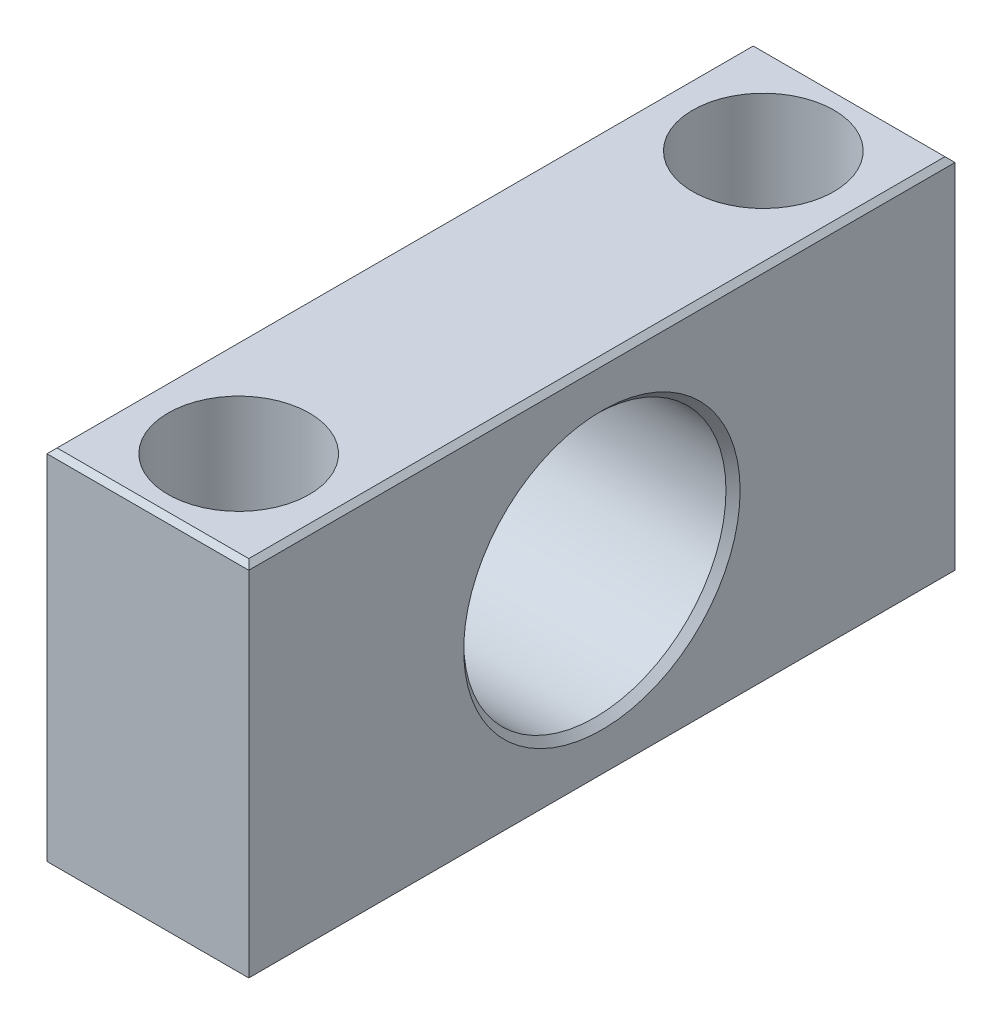
ISO-10303-21;
HEADER;
FILE_DESCRIPTION(('STEP AP214'),'2;1');
FILE_NAME('part.step','',(''),(''),'','','');
FILE_SCHEMA(('AUTOMOTIVE_DESIGN { 1 0 10303 214 1 1 1 1 }'));
ENDSEC;
DATA;
#1=APPLICATION_CONTEXT('core data for automotive mechanical design processes');
#2=APPLICATION_PROTOCOL_DEFINITION('international standard','automotive_design',2000,#1);
#3=PRODUCT_CONTEXT('',#1,'mechanical');
#4=PRODUCT('Part','Part','',(#3));
#5=PRODUCT_RELATED_PRODUCT_CATEGORY('part','',(#4));
#6=PRODUCT_DEFINITION_FORMATION('','',#4);
#7=PRODUCT_DEFINITION_CONTEXT('part definition',#1,'design');
#8=PRODUCT_DEFINITION('design','',#6,#7);
#9=PRODUCT_DEFINITION_SHAPE('','',#8);
#10=(LENGTH_UNIT() NAMED_UNIT(*) SI_UNIT(.MILLI.,.METRE.));
#11=(NAMED_UNIT(*) PLANE_ANGLE_UNIT() SI_UNIT($,.RADIAN.));
#12=(NAMED_UNIT(*) SI_UNIT($,.STERADIAN.) SOLID_ANGLE_UNIT());
#13=UNCERTAINTY_MEASURE_WITH_UNIT(LENGTH_MEASURE(1.E-05),#10,'distance_accuracy_value','');
#14=(GEOMETRIC_REPRESENTATION_CONTEXT(3) GLOBAL_UNCERTAINTY_ASSIGNED_CONTEXT((#13)) GLOBAL_UNIT_ASSIGNED_CONTEXT((#10,
#11,#12)) REPRESENTATION_CONTEXT('',''));
#15=CARTESIAN_POINT('',(0.,0.,0.));
#16=DIRECTION('',(0.,0.,1.));
#17=DIRECTION('',(1.,0.,0.));
#18=AXIS2_PLACEMENT_3D('',#15,#16,#17);
#19=CARTESIAN_POINT('',(15.75,-1.,26.));
#20=DIRECTION('',(0.,-1.,0.));
#21=DIRECTION('',(0.,0.,-1.));
#22=AXIS2_PLACEMENT_3D('',#19,#20,#21);
#23=PLANE('',#22);
#24=CARTESIAN_POINT('',(10.,-0.999999999999999,26.));
#25=DIRECTION('',(0.,-1.,0.));
#26=DIRECTION('',(0.,0.,-1.));
#27=AXIS2_PLACEMENT_3D('',#24,#25,#26);
#28=CIRCLE('',#27,4.5);
#29=CARTESIAN_POINT('',(10.,-0.999999999999999,21.5));
#30=VERTEX_POINT('',#29);
#31=EDGE_CURVE('E145',#30,#30,#28,.T.);
#32=ORIENTED_EDGE('',*,*,#31,.T.);
#33=EDGE_LOOP('',(#32));
#34=FACE_BOUND('',#33,.T.);
#35=CARTESIAN_POINT('',(10.,-1.,26.));
#36=DIRECTION('',(0.,-1.,0.));
#37=DIRECTION('',(0.,0.,-1.));
#38=AXIS2_PLACEMENT_3D('',#35,#36,#37);
#39=CIRCLE('',#38,7.);
#40=CARTESIAN_POINT('',(10.,-1.,19.));
#41=VERTEX_POINT('',#40);
#42=EDGE_CURVE('E147',#41,#41,#39,.F.);
#43=ORIENTED_EDGE('',*,*,#42,.T.);
#44=EDGE_LOOP('',(#43));
#45=FACE_BOUND('',#44,.T.);
#46=ADVANCED_FACE('F17',(#34,#45),#23,.F.);
#47=CARTESIAN_POINT('',(15.75,-1.,-26.));
#48=DIRECTION('',(0.,-1.,0.));
#49=DIRECTION('',(0.,0.,-1.));
#50=AXIS2_PLACEMENT_3D('',#47,#48,#49);
#51=PLANE('',#50);
#52=CARTESIAN_POINT('',(10.,-0.999999999999999,-26.));
#53=DIRECTION('',(0.,-1.,0.));
#54=DIRECTION('',(0.,0.,-1.));
#55=AXIS2_PLACEMENT_3D('',#52,#53,#54);
#56=CIRCLE('',#55,4.5);
#57=CARTESIAN_POINT('',(10.,-0.999999999999999,-30.5));
#58=VERTEX_POINT('',#57);
#59=EDGE_CURVE('E124',#58,#58,#56,.T.);
#60=ORIENTED_EDGE('',*,*,#59,.T.);
#61=EDGE_LOOP('',(#60));
#62=FACE_BOUND('',#61,.T.);
#63=CARTESIAN_POINT('',(10.,-1.,-26.));
#64=DIRECTION('',(0.,-1.,0.));
#65=DIRECTION('',(0.,0.,-1.));
#66=AXIS2_PLACEMENT_3D('',#63,#64,#65);
#67=CIRCLE('',#66,7.);
#68=CARTESIAN_POINT('',(10.,-1.,-33.));
#69=VERTEX_POINT('',#68);
#70=EDGE_CURVE('E20',#69,#69,#67,.F.);
#71=ORIENTED_EDGE('',*,*,#70,.T.);
#72=EDGE_LOOP('',(#71));
#73=FACE_BOUND('',#72,.T.);
#74=ADVANCED_FACE('F154',(#62,#73),#51,.F.);
#75=CARTESIAN_POINT('',(10.,8.5,-26.));
#76=DIRECTION('',(0.,-1.,0.));
#77=DIRECTION('',(0.,0.,-1.));
#78=AXIS2_PLACEMENT_3D('',#75,#76,#77);
#79=CYLINDRICAL_SURFACE('',#78,7.);
#80=CARTESIAN_POINT('',(10.,18.,-26.));
#81=DIRECTION('',(0.,-1.,0.));
#82=DIRECTION('',(0.,0.,-1.));
#83=AXIS2_PLACEMENT_3D('',#80,#81,#82);
#84=CIRCLE('',#83,7.);
#85=CARTESIAN_POINT('',(10.,18.,-33.));
#86=VERTEX_POINT('',#85);
#87=EDGE_CURVE('E109',#86,#86,#84,.T.);
#88=ORIENTED_EDGE('',*,*,#87,.F.);
#89=EDGE_LOOP('',(#88));
#90=FACE_BOUND('',#89,.T.);
#91=ORIENTED_EDGE('',*,*,#70,.F.);
#92=EDGE_LOOP('',(#91));
#93=FACE_BOUND('',#92,.T.);
#94=ADVANCED_FACE('F156',(#90,#93),#79,.F.);
#95=CARTESIAN_POINT('',(10.,8.5,26.));
#96=DIRECTION('',(0.,-1.,0.));
#97=DIRECTION('',(0.,0.,-1.));
#98=AXIS2_PLACEMENT_3D('',#95,#96,#97);
#99=CYLINDRICAL_SURFACE('',#98,7.);
#100=CARTESIAN_POINT('',(10.,18.,26.));
#101=DIRECTION('',(0.,-1.,0.));
#102=DIRECTION('',(0.,0.,-1.));
#103=AXIS2_PLACEMENT_3D('',#100,#101,#102);
#104=CIRCLE('',#103,7.);
#105=CARTESIAN_POINT('',(10.,18.,19.));
#106=VERTEX_POINT('',#105);
#107=EDGE_CURVE('E106',#106,#106,#104,.T.);
#108=ORIENTED_EDGE('',*,*,#107,.F.);
#109=EDGE_LOOP('',(#108));
#110=FACE_BOUND('',#109,.T.);
#111=ORIENTED_EDGE('',*,*,#42,.F.);
#112=EDGE_LOOP('',(#111));
#113=FACE_BOUND('',#112,.T.);
#114=ADVANCED_FACE('F158',(#110,#113),#99,.F.);
#115=CARTESIAN_POINT('',(0.,0.,0.));
#116=DIRECTION('',(-1.,0.,0.));
#117=DIRECTION('',(0.,0.,1.));
#118=AXIS2_PLACEMENT_3D('',#115,#116,#117);
#119=CONICAL_SURFACE('',#118,13.7,0.785398163397448);
#120=CARTESIAN_POINT('',(0.,0.,0.));
#121=DIRECTION('',(-1.,0.,0.));
#122=DIRECTION('',(0.,0.,1.));
#123=AXIS2_PLACEMENT_3D('',#120,#121,#122);
#124=CIRCLE('',#123,13.7);
#125=CARTESIAN_POINT('',(0.,0.,13.7));
#126=VERTEX_POINT('',#125);
#127=EDGE_CURVE('E136',#126,#126,#124,.F.);
#128=ORIENTED_EDGE('',*,*,#127,.F.);
#129=EDGE_LOOP('',(#128));
#130=FACE_BOUND('',#129,.T.);
#131=CARTESIAN_POINT('',(0.699999999999999,0.,0.));
#132=DIRECTION('',(1.,0.,0.));
#133=DIRECTION('',(0.,0.,-1.));
#134=AXIS2_PLACEMENT_3D('',#131,#132,#133);
#135=CIRCLE('',#134,13.);
#136=CARTESIAN_POINT('',(0.699999999999999,0.,-13.));
#137=VERTEX_POINT('',#136);
#138=EDGE_CURVE('E94',#137,#137,#135,.T.);
#139=ORIENTED_EDGE('',*,*,#138,.T.);
#140=EDGE_LOOP('',(#139));
#141=FACE_BOUND('',#140,.T.);
#142=ADVANCED_FACE('F166',(#130,#141),#119,.F.);
#143=CARTESIAN_POINT('',(0.5,18.,35.));
#144=DIRECTION('',(-0.707106781186548,0.707106781186548,0.));
#145=DIRECTION('',(-0.707106781186548,-0.707106781186548,0.));
#146=AXIS2_PLACEMENT_3D('',#143,#144,#145);
#147=PLANE('',#146);
#148=DIRECTION('',(-0.577350269189626,-0.577350269189626,-0.577350269189626));
#149=VECTOR('',#148,1.);
#150=CARTESIAN_POINT('',(0.499999999999987,18.,-34.5));
#151=LINE('',#150,#149);
#152=CARTESIAN_POINT('',(0.49999999999999,18.,-34.5));
#153=VERTEX_POINT('',#152);
#154=CARTESIAN_POINT('',(0.,17.5,-35.));
#155=VERTEX_POINT('',#154);
#156=EDGE_CURVE('E85',#153,#155,#151,.T.);
#157=ORIENTED_EDGE('',*,*,#156,.T.);
#158=DIRECTION('',(0.,0.,1.));
#159=VECTOR('',#158,1.);
#160=CARTESIAN_POINT('',(0.,17.5,35.));
#161=LINE('',#160,#159);
#162=CARTESIAN_POINT('',(0.,17.5,35.));
#163=VERTEX_POINT('',#162);
#164=EDGE_CURVE('E481',#163,#155,#161,.F.);
#165=ORIENTED_EDGE('',*,*,#164,.F.);
#166=DIRECTION('',(0.577350269189626,0.577350269189626,-0.577350269189626));
#167=VECTOR('',#166,1.);
#168=CARTESIAN_POINT('',(0.,17.5,35.));
#169=LINE('',#168,#167);
#170=CARTESIAN_POINT('',(0.499999999999993,18.,34.5));
#171=VERTEX_POINT('',#170);
#172=EDGE_CURVE('E79',#163,#171,#169,.T.);
#173=ORIENTED_EDGE('',*,*,#172,.T.);
#174=DIRECTION('',(0.,0.,1.));
#175=VECTOR('',#174,1.);
#176=CARTESIAN_POINT('',(0.5,18.,35.));
#177=LINE('',#176,#175);
#178=EDGE_CURVE('E96',#153,#171,#177,.T.);
#179=ORIENTED_EDGE('',*,*,#178,.F.);
#180=EDGE_LOOP('',(#157,#165,#173,#179));
#181=FACE_BOUND('',#180,.T.);
#182=ADVANCED_FACE('F97',(#181),#147,.T.);
#183=CARTESIAN_POINT('',(0.,-17.5,35.));
#184=DIRECTION('',(-0.707106781186548,-0.707106781186548,0.));
#185=DIRECTION('',(0.707106781186548,-0.707106781186548,0.));
#186=AXIS2_PLACEMENT_3D('',#183,#184,#185);
#187=PLANE('',#186);
#188=DIRECTION('',(0.577350269189626,-0.577350269189626,0.577350269189626));
#189=VECTOR('',#188,1.);
#190=CARTESIAN_POINT('',(0.,-17.5,-35.));
#191=LINE('',#190,#189);
#192=CARTESIAN_POINT('',(0.,-17.5,-35.));
#193=VERTEX_POINT('',#192);
#194=CARTESIAN_POINT('',(0.499999999999985,-18.,-34.5));
#195=VERTEX_POINT('',#194);
#196=EDGE_CURVE('E115',#193,#195,#191,.T.);
#197=ORIENTED_EDGE('',*,*,#196,.T.);
#198=DIRECTION('',(0.,0.,-1.));
#199=VECTOR('',#198,1.);
#200=CARTESIAN_POINT('',(0.5,-18.,35.));
#201=LINE('',#200,#199);
#202=CARTESIAN_POINT('',(0.499999999999991,-18.,34.5));
#203=VERTEX_POINT('',#202);
#204=EDGE_CURVE('E135',#203,#195,#201,.T.);
#205=ORIENTED_EDGE('',*,*,#204,.F.);
#206=DIRECTION('',(-0.577350269189626,0.577350269189626,0.577350269189626));
#207=VECTOR('',#206,1.);
#208=CARTESIAN_POINT('',(0.499999999999987,-18.,34.5));
#209=LINE('',#208,#207);
#210=CARTESIAN_POINT('',(0.,-17.5,35.));
#211=VERTEX_POINT('',#210);
#212=EDGE_CURVE('E100',#203,#211,#209,.T.);
#213=ORIENTED_EDGE('',*,*,#212,.T.);
#214=DIRECTION('',(0.,0.,1.));
#215=VECTOR('',#214,1.);
#216=CARTESIAN_POINT('',(0.,-17.5,35.));
#217=LINE('',#216,#215);
#218=EDGE_CURVE('E138',#193,#211,#217,.T.);
#219=ORIENTED_EDGE('',*,*,#218,.F.);
#220=EDGE_LOOP('',(#197,#205,#213,#219));
#221=FACE_BOUND('',#220,.T.);
#222=ADVANCED_FACE('F234',(#221),#187,.T.);
#223=CARTESIAN_POINT('',(10.,-9.5,26.));
#224=DIRECTION('',(0.,-1.,0.));
#225=DIRECTION('',(0.,0.,-1.));
#226=AXIS2_PLACEMENT_3D('',#223,#224,#225);
#227=CYLINDRICAL_SURFACE('',#226,4.5);
#228=CARTESIAN_POINT('',(10.,-18.,26.));
#229=DIRECTION('',(0.,-1.,0.));
#230=DIRECTION('',(0.,0.,-1.));
#231=AXIS2_PLACEMENT_3D('',#228,#229,#230);
#232=CIRCLE('',#231,4.5);
#233=CARTESIAN_POINT('',(10.,-18.,21.5));
#234=VERTEX_POINT('',#233);
#235=EDGE_CURVE('E132',#234,#234,#232,.F.);
#236=ORIENTED_EDGE('',*,*,#235,.F.);
#237=EDGE_LOOP('',(#236));
#238=FACE_BOUND('',#237,.T.);
#239=ORIENTED_EDGE('',*,*,#31,.F.);
#240=EDGE_LOOP('',(#239));
#241=FACE_BOUND('',#240,.T.);
#242=ADVANCED_FACE('F230',(#238,#241),#227,.F.);
#243=CARTESIAN_POINT('',(10.,-9.5,-26.));
#244=DIRECTION('',(0.,-1.,0.));
#245=DIRECTION('',(0.,0.,-1.));
#246=AXIS2_PLACEMENT_3D('',#243,#244,#245);
#247=CYLINDRICAL_SURFACE('',#246,4.5);
#248=CARTESIAN_POINT('',(10.,-18.,-26.));
#249=DIRECTION('',(0.,-1.,0.));
#250=DIRECTION('',(0.,0.,-1.));
#251=AXIS2_PLACEMENT_3D('',#248,#249,#250);
#252=CIRCLE('',#251,4.5);
#253=CARTESIAN_POINT('',(10.,-18.,-30.5));
#254=VERTEX_POINT('',#253);
#255=EDGE_CURVE('E121',#254,#254,#252,.F.);
#256=ORIENTED_EDGE('',*,*,#255,.F.);
#257=EDGE_LOOP('',(#256));
#258=FACE_BOUND('',#257,.T.);
#259=ORIENTED_EDGE('',*,*,#59,.F.);
#260=EDGE_LOOP('',(#259));
#261=FACE_BOUND('',#260,.T.);
#262=ADVANCED_FACE('F226',(#258,#261),#247,.F.);
#263=CARTESIAN_POINT('',(10.,0.,0.));
#264=DIRECTION('',(1.,0.,0.));
#265=DIRECTION('',(0.,0.,-1.));
#266=AXIS2_PLACEMENT_3D('',#263,#264,#265);
#267=CYLINDRICAL_SURFACE('',#266,13.);
#268=CARTESIAN_POINT('',(19.3,0.,0.));
#269=DIRECTION('',(1.,0.,0.));
#270=DIRECTION('',(0.,1.,0.));
#271=AXIS2_PLACEMENT_3D('',#268,#269,#270);
#272=CIRCLE('',#271,13.);
#273=CARTESIAN_POINT('',(19.3,13.,0.));
#274=VERTEX_POINT('',#273);
#275=EDGE_CURVE('E118',#274,#274,#272,.T.);
#276=ORIENTED_EDGE('',*,*,#275,.T.);
#277=EDGE_LOOP('',(#276));
#278=FACE_BOUND('',#277,.T.);
#279=ORIENTED_EDGE('',*,*,#138,.F.);
#280=EDGE_LOOP('',(#279));
#281=FACE_BOUND('',#280,.T.);
#282=ADVANCED_FACE('F223',(#278,#281),#267,.F.);
#283=CARTESIAN_POINT('',(35.,18.,-34.5));
#284=DIRECTION('',(0.,-0.707106781186548,0.707106781186548));
#285=DIRECTION('',(0.,-0.707106781186548,-0.707106781186548));
#286=AXIS2_PLACEMENT_3D('',#283,#284,#285);
#287=PLANE('',#286);
#288=DIRECTION('',(1.,0.,0.));
#289=VECTOR('',#288,1.);
#290=CARTESIAN_POINT('',(0.,17.5,-35.));
#291=LINE('',#290,#289);
#292=CARTESIAN_POINT('',(20.,17.5,-35.));
#293=VERTEX_POINT('',#292);
#294=EDGE_CURVE('E91',#293,#155,#291,.F.);
#295=ORIENTED_EDGE('',*,*,#294,.T.);
#296=ORIENTED_EDGE('',*,*,#156,.F.);
#297=DIRECTION('',(1.,0.,0.));
#298=VECTOR('',#297,1.);
#299=CARTESIAN_POINT('',(19.5,18.,-34.5));
#300=LINE('',#299,#298);
#301=CARTESIAN_POINT('',(19.5,18.,-34.5));
#302=VERTEX_POINT('',#301);
#303=EDGE_CURVE('E88',#302,#153,#300,.F.);
#304=ORIENTED_EDGE('',*,*,#303,.F.);
#305=DIRECTION('',(-0.577350269189626,0.577350269189626,0.577350269189626));
#306=VECTOR('',#305,1.);
#307=CARTESIAN_POINT('',(20.,17.5,-35.));
#308=LINE('',#307,#306);
#309=EDGE_CURVE('E93',#293,#302,#308,.T.);
#310=ORIENTED_EDGE('',*,*,#309,.F.);
#311=EDGE_LOOP('',(#295,#296,#304,#310));
#312=FACE_BOUND('',#311,.T.);
#313=ADVANCED_FACE('F86',(#312),#287,.F.);
#314=CARTESIAN_POINT('',(35.,-17.5,-35.));
#315=DIRECTION('',(0.,0.707106781186548,0.707106781186548));
#316=DIRECTION('',(0.,-0.707106781186548,0.707106781186548));
#317=AXIS2_PLACEMENT_3D('',#314,#315,#316);
#318=PLANE('',#317);
#319=DIRECTION('',(1.,0.,0.));
#320=VECTOR('',#319,1.);
#321=CARTESIAN_POINT('',(0.5,-18.,-34.5));
#322=LINE('',#321,#320);
#323=CARTESIAN_POINT('',(19.5,-18.,-34.5));
#324=VERTEX_POINT('',#323);
#325=EDGE_CURVE('E476',#195,#324,#322,.T.);
#326=ORIENTED_EDGE('',*,*,#325,.F.);
#327=ORIENTED_EDGE('',*,*,#196,.F.);
#328=DIRECTION('',(1.,0.,0.));
#329=VECTOR('',#328,1.);
#330=CARTESIAN_POINT('',(0.,-17.5,-35.));
#331=LINE('',#330,#329);
#332=CARTESIAN_POINT('',(20.,-17.5,-35.));
#333=VERTEX_POINT('',#332);
#334=EDGE_CURVE('E512',#193,#333,#331,.T.);
#335=ORIENTED_EDGE('',*,*,#334,.T.);
#336=DIRECTION('',(0.577350269189626,0.577350269189626,-0.577350269189626));
#337=VECTOR('',#336,1.);
#338=CARTESIAN_POINT('',(19.5,-18.,-34.5));
#339=LINE('',#338,#337);
#340=EDGE_CURVE('E113',#324,#333,#339,.T.);
#341=ORIENTED_EDGE('',*,*,#340,.F.);
#342=EDGE_LOOP('',(#326,#327,#335,#341));
#343=FACE_BOUND('',#342,.T.);
#344=ADVANCED_FACE('F217',(#343),#318,.F.);
#345=CARTESIAN_POINT('',(19.5,18.,35.));
#346=DIRECTION('',(0.,1.,0.));
#347=DIRECTION('',(0.,0.,1.));
#348=AXIS2_PLACEMENT_3D('',#345,#346,#347);
#349=PLANE('',#348);
#350=DIRECTION('',(1.,0.,0.));
#351=VECTOR('',#350,1.);
#352=CARTESIAN_POINT('',(35.,18.,34.5));
#353=LINE('',#352,#351);
#354=CARTESIAN_POINT('',(19.5,18.,34.5));
#355=VERTEX_POINT('',#354);
#356=EDGE_CURVE('E139',#171,#355,#353,.T.);
#357=ORIENTED_EDGE('',*,*,#356,.T.);
#358=DIRECTION('',(0.,0.,1.));
#359=VECTOR('',#358,1.);
#360=CARTESIAN_POINT('',(19.5,18.,35.));
#361=LINE('',#360,#359);
#362=EDGE_CURVE('E105',#302,#355,#361,.T.);
#363=ORIENTED_EDGE('',*,*,#362,.F.);
#364=ORIENTED_EDGE('',*,*,#303,.T.);
#365=ORIENTED_EDGE('',*,*,#178,.T.);
#366=EDGE_LOOP('',(#357,#363,#364,#365));
#367=FACE_BOUND('',#366,.T.);
#368=ORIENTED_EDGE('',*,*,#107,.T.);
#369=EDGE_LOOP('',(#368));
#370=FACE_BOUND('',#369,.T.);
#371=ORIENTED_EDGE('',*,*,#87,.T.);
#372=EDGE_LOOP('',(#371));
#373=FACE_BOUND('',#372,.T.);
#374=ADVANCED_FACE('F102',(#367,#370,#373),#349,.T.);
#375=CARTESIAN_POINT('',(35.,-18.,34.5));
#376=DIRECTION('',(0.,0.707106781186548,-0.707106781186548));
#377=DIRECTION('',(0.,0.707106781186548,0.707106781186548));
#378=AXIS2_PLACEMENT_3D('',#375,#376,#377);
#379=PLANE('',#378);
#380=DIRECTION('',(1.,0.,0.));
#381=VECTOR('',#380,1.);
#382=CARTESIAN_POINT('',(0.,-17.5,35.));
#383=LINE('',#382,#381);
#384=CARTESIAN_POINT('',(20.,-17.5,35.));
#385=VERTEX_POINT('',#384);
#386=EDGE_CURVE('E492',#211,#385,#383,.T.);
#387=ORIENTED_EDGE('',*,*,#386,.F.);
#388=ORIENTED_EDGE('',*,*,#212,.F.);
#389=DIRECTION('',(1.,0.,0.));
#390=VECTOR('',#389,1.);
#391=CARTESIAN_POINT('',(0.5,-18.,34.5));
#392=LINE('',#391,#390);
#393=CARTESIAN_POINT('',(19.5,-18.,34.5));
#394=VERTEX_POINT('',#393);
#395=EDGE_CURVE('E480',#394,#203,#392,.F.);
#396=ORIENTED_EDGE('',*,*,#395,.F.);
#397=DIRECTION('',(-0.577350269189626,-0.577350269189626,-0.577350269189626));
#398=VECTOR('',#397,1.);
#399=CARTESIAN_POINT('',(20.,-17.5,35.));
#400=LINE('',#399,#398);
#401=EDGE_CURVE('E35',#385,#394,#400,.T.);
#402=ORIENTED_EDGE('',*,*,#401,.F.);
#403=EDGE_LOOP('',(#387,#388,#396,#402));
#404=FACE_BOUND('',#403,.T.);
#405=ADVANCED_FACE('F211',(#404),#379,.F.);
#406=CARTESIAN_POINT('',(35.,17.5,35.));
#407=DIRECTION('',(0.,-0.707106781186548,-0.707106781186548));
#408=DIRECTION('',(0.,0.707106781186548,-0.707106781186548));
#409=AXIS2_PLACEMENT_3D('',#406,#407,#408);
#410=PLANE('',#409);
#411=ORIENTED_EDGE('',*,*,#356,.F.);
#412=ORIENTED_EDGE('',*,*,#172,.F.);
#413=DIRECTION('',(1.,0.,0.));
#414=VECTOR('',#413,1.);
#415=CARTESIAN_POINT('',(0.,17.5,35.));
#416=LINE('',#415,#414);
#417=CARTESIAN_POINT('',(20.,17.5,35.));
#418=VERTEX_POINT('',#417);
#419=EDGE_CURVE('E496',#418,#163,#416,.F.);
#420=ORIENTED_EDGE('',*,*,#419,.F.);
#421=DIRECTION('',(0.577350269189626,-0.577350269189626,0.577350269189626));
#422=VECTOR('',#421,1.);
#423=CARTESIAN_POINT('',(19.5,18.,34.5));
#424=LINE('',#423,#422);
#425=EDGE_CURVE('E497',#355,#418,#424,.T.);
#426=ORIENTED_EDGE('',*,*,#425,.F.);
#427=EDGE_LOOP('',(#411,#412,#420,#426));
#428=FACE_BOUND('',#427,.T.);
#429=ADVANCED_FACE('F207',(#428),#410,.F.);
#430=CARTESIAN_POINT('',(0.,17.5,35.));
#431=DIRECTION('',(-1.,0.,0.));
#432=DIRECTION('',(0.,0.,1.));
#433=AXIS2_PLACEMENT_3D('',#430,#431,#432);
#434=PLANE('',#433);
#435=DIRECTION('',(0.,1.,0.));
#436=VECTOR('',#435,1.);
#437=CARTESIAN_POINT('',(0.,0.,35.));
#438=LINE('',#437,#436);
#439=EDGE_CURVE('E500',#163,#211,#438,.F.);
#440=ORIENTED_EDGE('',*,*,#439,.F.);
#441=ORIENTED_EDGE('',*,*,#164,.T.);
#442=DIRECTION('',(0.,1.,0.));
#443=VECTOR('',#442,1.);
#444=CARTESIAN_POINT('',(0.,0.,-35.));
#445=LINE('',#444,#443);
#446=EDGE_CURVE('E503',#155,#193,#445,.F.);
#447=ORIENTED_EDGE('',*,*,#446,.T.);
#448=ORIENTED_EDGE('',*,*,#218,.T.);
#449=EDGE_LOOP('',(#440,#441,#447,#448));
#450=FACE_BOUND('',#449,.T.);
#451=ORIENTED_EDGE('',*,*,#127,.T.);
#452=EDGE_LOOP('',(#451));
#453=FACE_BOUND('',#452,.T.);
#454=ADVANCED_FACE('F203',(#450,#453),#434,.T.);
#455=CARTESIAN_POINT('',(0.5,-18.,35.));
#456=DIRECTION('',(0.,-1.,0.));
#457=DIRECTION('',(0.,0.,-1.));
#458=AXIS2_PLACEMENT_3D('',#455,#456,#457);
#459=PLANE('',#458);
#460=ORIENTED_EDGE('',*,*,#255,.T.);
#461=EDGE_LOOP('',(#460));
#462=FACE_BOUND('',#461,.T.);
#463=ORIENTED_EDGE('',*,*,#235,.T.);
#464=EDGE_LOOP('',(#463));
#465=FACE_BOUND('',#464,.T.);
#466=ORIENTED_EDGE('',*,*,#395,.T.);
#467=ORIENTED_EDGE('',*,*,#204,.T.);
#468=ORIENTED_EDGE('',*,*,#325,.T.);
#469=DIRECTION('',(0.,0.,1.));
#470=VECTOR('',#469,1.);
#471=CARTESIAN_POINT('',(19.5,-18.,35.));
#472=LINE('',#471,#470);
#473=EDGE_CURVE('E129',#394,#324,#472,.F.);
#474=ORIENTED_EDGE('',*,*,#473,.F.);
#475=EDGE_LOOP('',(#466,#467,#468,#474));
#476=FACE_BOUND('',#475,.T.);
#477=ADVANCED_FACE('F199',(#462,#465,#476),#459,.T.);
#478=CARTESIAN_POINT('',(20.,0.,0.));
#479=DIRECTION('',(1.,0.,0.));
#480=DIRECTION('',(0.,0.,-1.));
#481=AXIS2_PLACEMENT_3D('',#478,#479,#480);
#482=CONICAL_SURFACE('',#481,13.7,0.785398163397448);
#483=CARTESIAN_POINT('',(20.,0.,0.));
#484=DIRECTION('',(1.,0.,0.));
#485=DIRECTION('',(0.,0.,-1.));
#486=AXIS2_PLACEMENT_3D('',#483,#484,#485);
#487=CIRCLE('',#486,13.7);
#488=CARTESIAN_POINT('',(20.,0.,-13.7));
#489=VERTEX_POINT('',#488);
#490=EDGE_CURVE('E125',#489,#489,#487,.F.);
#491=ORIENTED_EDGE('',*,*,#490,.F.);
#492=EDGE_LOOP('',(#491));
#493=FACE_BOUND('',#492,.T.);
#494=ORIENTED_EDGE('',*,*,#275,.F.);
#495=EDGE_LOOP('',(#494));
#496=FACE_BOUND('',#495,.T.);
#497=ADVANCED_FACE('F195',(#493,#496),#482,.F.);
#498=CARTESIAN_POINT('',(0.,0.,-35.));
#499=DIRECTION('',(0.,0.,1.));
#500=DIRECTION('',(1.,0.,0.));
#501=AXIS2_PLACEMENT_3D('',#498,#499,#500);
#502=PLANE('',#501);
#503=ORIENTED_EDGE('',*,*,#446,.F.);
#504=ORIENTED_EDGE('',*,*,#294,.F.);
#505=DIRECTION('',(0.,1.,0.));
#506=VECTOR('',#505,1.);
#507=CARTESIAN_POINT('',(20.,-17.5,-35.));
#508=LINE('',#507,#506);
#509=EDGE_CURVE('E128',#333,#293,#508,.T.);
#510=ORIENTED_EDGE('',*,*,#509,.F.);
#511=ORIENTED_EDGE('',*,*,#334,.F.);
#512=EDGE_LOOP('',(#503,#504,#510,#511));
#513=FACE_BOUND('',#512,.T.);
#514=ADVANCED_FACE('F191',(#513),#502,.F.);
#515=CARTESIAN_POINT('',(20.,17.5,35.));
#516=DIRECTION('',(0.707106781186548,0.707106781186548,0.));
#517=DIRECTION('',(-0.707106781186548,0.707106781186548,0.));
#518=AXIS2_PLACEMENT_3D('',#515,#516,#517);
#519=PLANE('',#518);
#520=ORIENTED_EDGE('',*,*,#425,.T.);
#521=DIRECTION('',(0.,0.,-1.));
#522=VECTOR('',#521,1.);
#523=CARTESIAN_POINT('',(20.,17.5,35.));
#524=LINE('',#523,#522);
#525=EDGE_CURVE('E517',#293,#418,#524,.F.);
#526=ORIENTED_EDGE('',*,*,#525,.F.);
#527=ORIENTED_EDGE('',*,*,#309,.T.);
#528=ORIENTED_EDGE('',*,*,#362,.T.);
#529=EDGE_LOOP('',(#520,#526,#527,#528));
#530=FACE_BOUND('',#529,.T.);
#531=ADVANCED_FACE('F187',(#530),#519,.T.);
#532=CARTESIAN_POINT('',(0.,0.,35.));
#533=DIRECTION('',(0.,0.,1.));
#534=DIRECTION('',(1.,0.,0.));
#535=AXIS2_PLACEMENT_3D('',#532,#533,#534);
#536=PLANE('',#535);
#537=ORIENTED_EDGE('',*,*,#419,.T.);
#538=ORIENTED_EDGE('',*,*,#439,.T.);
#539=ORIENTED_EDGE('',*,*,#386,.T.);
#540=DIRECTION('',(0.,1.,0.));
#541=VECTOR('',#540,1.);
#542=CARTESIAN_POINT('',(20.,-17.5,35.));
#543=LINE('',#542,#541);
#544=EDGE_CURVE('E26',#418,#385,#543,.F.);
#545=ORIENTED_EDGE('',*,*,#544,.F.);
#546=EDGE_LOOP('',(#537,#538,#539,#545));
#547=FACE_BOUND('',#546,.T.);
#548=ADVANCED_FACE('F179',(#547),#536,.T.);
#549=CARTESIAN_POINT('',(19.5,-18.,35.));
#550=DIRECTION('',(0.707106781186548,-0.707106781186548,0.));
#551=DIRECTION('',(0.707106781186548,0.707106781186548,0.));
#552=AXIS2_PLACEMENT_3D('',#549,#550,#551);
#553=PLANE('',#552);
#554=ORIENTED_EDGE('',*,*,#401,.T.);
#555=ORIENTED_EDGE('',*,*,#473,.T.);
#556=ORIENTED_EDGE('',*,*,#340,.T.);
#557=DIRECTION('',(0.,0.,-1.));
#558=VECTOR('',#557,1.);
#559=CARTESIAN_POINT('',(20.,-17.5,35.));
#560=LINE('',#559,#558);
#561=EDGE_CURVE('E11',#385,#333,#560,.T.);
#562=ORIENTED_EDGE('',*,*,#561,.F.);
#563=EDGE_LOOP('',(#554,#555,#556,#562));
#564=FACE_BOUND('',#563,.T.);
#565=ADVANCED_FACE('F173',(#564),#553,.T.);
#566=CARTESIAN_POINT('',(20.,-17.5,35.));
#567=DIRECTION('',(1.,0.,0.));
#568=DIRECTION('',(0.,0.,-1.));
#569=AXIS2_PLACEMENT_3D('',#566,#567,#568);
#570=PLANE('',#569);
#571=ORIENTED_EDGE('',*,*,#544,.T.);
#572=ORIENTED_EDGE('',*,*,#561,.T.);
#573=ORIENTED_EDGE('',*,*,#509,.T.);
#574=ORIENTED_EDGE('',*,*,#525,.T.);
#575=EDGE_LOOP('',(#571,#572,#573,#574));
#576=FACE_BOUND('',#575,.T.);
#577=ORIENTED_EDGE('',*,*,#490,.T.);
#578=EDGE_LOOP('',(#577));
#579=FACE_BOUND('',#578,.T.);
#580=ADVANCED_FACE('F171',(#576,#579),#570,.T.);
#581=CLOSED_SHELL('',(#46,#74,#94,#114,#142,#182,#222,#242,#262,#282,#313,#344,#374,#405,#429,
#454,#477,#497,#514,#531,#548,#565,#580));
#582=MANIFOLD_SOLID_BREP('B1',#581);
#583=ADVANCED_BREP_SHAPE_REPRESENTATION('',(#18,#582),#14);
#584=SHAPE_DEFINITION_REPRESENTATION(#9,#583);
ENDSEC;
END-ISO-10303-21;
